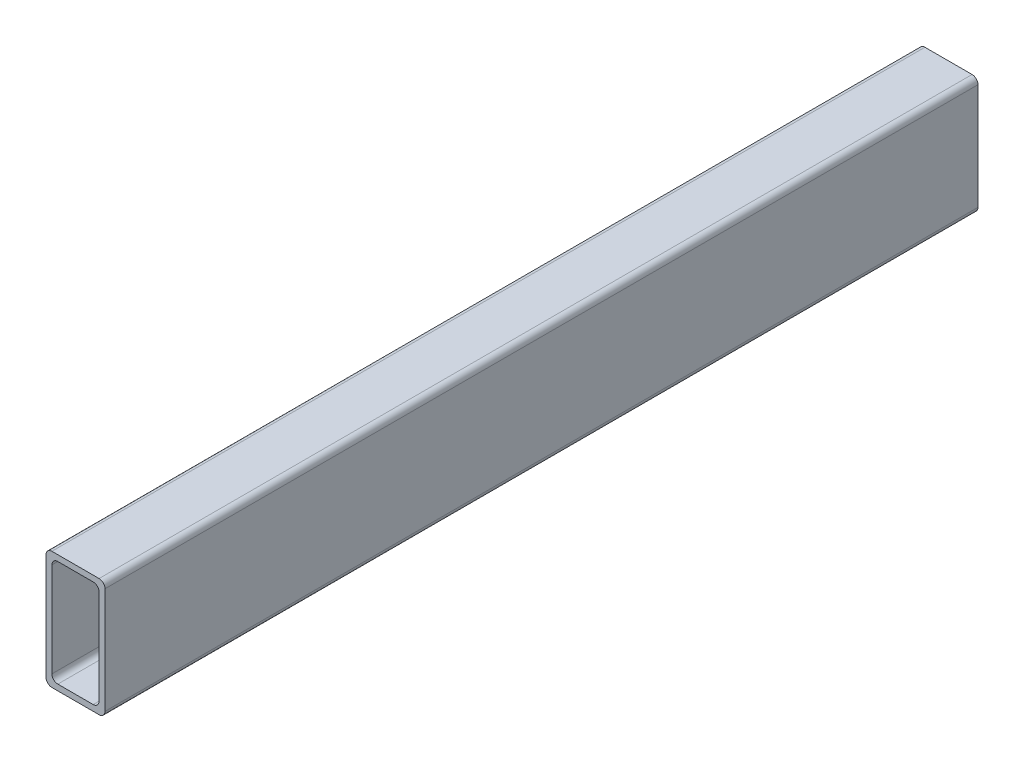
ISO-10303-21;
HEADER;
FILE_DESCRIPTION(('STEP AP214'),'2;1');
FILE_NAME('part.step','',(''),(''),'','','');
FILE_SCHEMA(('AUTOMOTIVE_DESIGN { 1 0 10303 214 1 1 1 1 }'));
ENDSEC;
DATA;
#1=APPLICATION_CONTEXT('core data for automotive mechanical design processes');
#2=APPLICATION_PROTOCOL_DEFINITION('international standard','automotive_design',2000,#1);
#3=PRODUCT_CONTEXT('',#1,'mechanical');
#4=PRODUCT('Part','Part','',(#3));
#5=PRODUCT_RELATED_PRODUCT_CATEGORY('part','',(#4));
#6=PRODUCT_DEFINITION_FORMATION('','',#4);
#7=PRODUCT_DEFINITION_CONTEXT('part definition',#1,'design');
#8=PRODUCT_DEFINITION('design','',#6,#7);
#9=PRODUCT_DEFINITION_SHAPE('','',#8);
#10=(LENGTH_UNIT() NAMED_UNIT(*) SI_UNIT(.MILLI.,.METRE.));
#11=(NAMED_UNIT(*) PLANE_ANGLE_UNIT() SI_UNIT($,.RADIAN.));
#12=(NAMED_UNIT(*) SI_UNIT($,.STERADIAN.) SOLID_ANGLE_UNIT());
#13=UNCERTAINTY_MEASURE_WITH_UNIT(LENGTH_MEASURE(1.E-05),#10,'distance_accuracy_value','');
#14=(GEOMETRIC_REPRESENTATION_CONTEXT(3) GLOBAL_UNCERTAINTY_ASSIGNED_CONTEXT((#13)) GLOBAL_UNIT_ASSIGNED_CONTEXT((#10,
#11,#12)) REPRESENTATION_CONTEXT('',''));
#15=CARTESIAN_POINT('',(0.,0.,0.));
#16=DIRECTION('',(0.,0.,1.));
#17=DIRECTION('',(1.,0.,0.));
#18=AXIS2_PLACEMENT_3D('',#15,#16,#17);
#19=CARTESIAN_POINT('',(-10.0000000000002,47.5000000000001,-370.));
#20=DIRECTION('',(0.,0.,1.));
#21=DIRECTION('',(1.,0.,0.));
#22=AXIS2_PLACEMENT_3D('',#19,#20,#21);
#23=CYLINDRICAL_SURFACE('',#22,2.49999999999995);
#24=CARTESIAN_POINT('',(-10.0000000000002,47.5000000000001,0.));
#25=DIRECTION('',(0.,0.,1.));
#26=DIRECTION('',(1.,0.,0.));
#27=AXIS2_PLACEMENT_3D('',#24,#25,#26);
#28=CIRCLE('',#27,2.49999999999995);
#29=CARTESIAN_POINT('',(-10.0000000000002,50.,0.));
#30=VERTEX_POINT('',#29);
#31=CARTESIAN_POINT('',(-12.5000000000002,47.5000000000001,0.));
#32=VERTEX_POINT('',#31);
#33=EDGE_CURVE('E203',#30,#32,#28,.T.);
#34=ORIENTED_EDGE('',*,*,#33,.F.);
#35=DIRECTION('',(0.,0.,1.));
#36=VECTOR('',#35,1.);
#37=CARTESIAN_POINT('',(-10.0000000000002,50.,-370.));
#38=LINE('',#37,#36);
#39=CARTESIAN_POINT('',(-10.0000000000002,50.,-370.));
#40=VERTEX_POINT('',#39);
#41=EDGE_CURVE('E11',#40,#30,#38,.T.);
#42=ORIENTED_EDGE('',*,*,#41,.F.);
#43=CARTESIAN_POINT('',(-10.0000000000002,47.5000000000001,-370.));
#44=DIRECTION('',(0.,0.,1.));
#45=DIRECTION('',(1.,0.,0.));
#46=AXIS2_PLACEMENT_3D('',#43,#44,#45);
#47=CIRCLE('',#46,2.49999999999995);
#48=CARTESIAN_POINT('',(-12.5000000000002,47.5000000000001,-370.));
#49=VERTEX_POINT('',#48);
#50=EDGE_CURVE('E215',#40,#49,#47,.T.);
#51=ORIENTED_EDGE('',*,*,#50,.T.);
#52=DIRECTION('',(0.,0.,1.));
#53=VECTOR('',#52,1.);
#54=CARTESIAN_POINT('',(-12.5000000000002,47.5000000000001,-370.));
#55=LINE('',#54,#53);
#56=EDGE_CURVE('E36',#49,#32,#55,.T.);
#57=ORIENTED_EDGE('',*,*,#56,.T.);
#58=EDGE_LOOP('',(#34,#42,#51,#57));
#59=FACE_BOUND('',#58,.T.);
#60=ADVANCED_FACE('F33',(#59),#23,.T.);
#61=CARTESIAN_POINT('',(-10.0000000000002,50.,-370.));
#62=DIRECTION('',(0.,1.,0.));
#63=DIRECTION('',(0.,0.,1.));
#64=AXIS2_PLACEMENT_3D('',#61,#62,#63);
#65=PLANE('',#64);
#66=DIRECTION('',(-1.,0.,0.));
#67=VECTOR('',#66,1.);
#68=CARTESIAN_POINT('',(-10.0000000000002,50.,0.));
#69=LINE('',#68,#67);
#70=CARTESIAN_POINT('',(9.99999999999979,50.,0.));
#71=VERTEX_POINT('',#70);
#72=EDGE_CURVE('E219',#71,#30,#69,.T.);
#73=ORIENTED_EDGE('',*,*,#72,.F.);
#74=DIRECTION('',(0.,0.,1.));
#75=VECTOR('',#74,1.);
#76=CARTESIAN_POINT('',(9.99999999999979,50.,-370.));
#77=LINE('',#76,#75);
#78=CARTESIAN_POINT('',(9.99999999999979,50.,-370.));
#79=VERTEX_POINT('',#78);
#80=EDGE_CURVE('E41',#79,#71,#77,.T.);
#81=ORIENTED_EDGE('',*,*,#80,.F.);
#82=DIRECTION('',(-1.,0.,0.));
#83=VECTOR('',#82,1.);
#84=CARTESIAN_POINT('',(-10.0000000000002,50.,-370.));
#85=LINE('',#84,#83);
#86=EDGE_CURVE('E237',#79,#40,#85,.T.);
#87=ORIENTED_EDGE('',*,*,#86,.T.);
#88=ORIENTED_EDGE('',*,*,#41,.T.);
#89=EDGE_LOOP('',(#73,#81,#87,#88));
#90=FACE_BOUND('',#89,.T.);
#91=ADVANCED_FACE('F284',(#90),#65,.T.);
#92=CARTESIAN_POINT('',(9.99999999999934,47.5000000000001,-370.));
#93=DIRECTION('',(0.,0.,1.));
#94=DIRECTION('',(1.,0.,0.));
#95=AXIS2_PLACEMENT_3D('',#92,#93,#94);
#96=CYLINDRICAL_SURFACE('',#95,2.50000000000017);
#97=CARTESIAN_POINT('',(9.99999999999934,47.5000000000001,0.));
#98=DIRECTION('',(0.,0.,1.));
#99=DIRECTION('',(1.,0.,0.));
#100=AXIS2_PLACEMENT_3D('',#97,#98,#99);
#101=CIRCLE('',#100,2.50000000000017);
#102=CARTESIAN_POINT('',(12.4999999999995,47.5000000000001,0.));
#103=VERTEX_POINT('',#102);
#104=EDGE_CURVE('E257',#103,#71,#101,.T.);
#105=ORIENTED_EDGE('',*,*,#104,.F.);
#106=DIRECTION('',(0.,0.,1.));
#107=VECTOR('',#106,1.);
#108=CARTESIAN_POINT('',(12.4999999999995,47.5000000000001,-370.));
#109=LINE('',#108,#107);
#110=CARTESIAN_POINT('',(12.4999999999995,47.5000000000001,-370.));
#111=VERTEX_POINT('',#110);
#112=EDGE_CURVE('E263',#111,#103,#109,.T.);
#113=ORIENTED_EDGE('',*,*,#112,.F.);
#114=CARTESIAN_POINT('',(9.99999999999934,47.5000000000001,-370.));
#115=DIRECTION('',(0.,0.,1.));
#116=DIRECTION('',(1.,0.,0.));
#117=AXIS2_PLACEMENT_3D('',#114,#115,#116);
#118=CIRCLE('',#117,2.50000000000017);
#119=EDGE_CURVE('E234',#111,#79,#118,.T.);
#120=ORIENTED_EDGE('',*,*,#119,.T.);
#121=ORIENTED_EDGE('',*,*,#80,.T.);
#122=EDGE_LOOP('',(#105,#113,#120,#121));
#123=FACE_BOUND('',#122,.T.);
#124=ADVANCED_FACE('F303',(#123),#96,.T.);
#125=CARTESIAN_POINT('',(12.4999999999997,47.5000000000001,-370.));
#126=DIRECTION('',(1.,0.,0.));
#127=DIRECTION('',(0.,0.,-1.));
#128=AXIS2_PLACEMENT_3D('',#125,#126,#127);
#129=PLANE('',#128);
#130=DIRECTION('',(0.,1.,0.));
#131=VECTOR('',#130,1.);
#132=CARTESIAN_POINT('',(12.4999999999997,47.5000000000001,0.));
#133=LINE('',#132,#131);
#134=CARTESIAN_POINT('',(12.4999999999997,2.49999999999995,0.));
#135=VERTEX_POINT('',#134);
#136=EDGE_CURVE('E254',#135,#103,#133,.T.);
#137=ORIENTED_EDGE('',*,*,#136,.F.);
#138=DIRECTION('',(0.,0.,1.));
#139=VECTOR('',#138,1.);
#140=CARTESIAN_POINT('',(12.4999999999997,2.49999999999995,-370.));
#141=LINE('',#140,#139);
#142=CARTESIAN_POINT('',(12.4999999999997,2.49999999999995,-370.));
#143=VERTEX_POINT('',#142);
#144=EDGE_CURVE('E265',#143,#135,#141,.T.);
#145=ORIENTED_EDGE('',*,*,#144,.F.);
#146=DIRECTION('',(0.,1.,0.));
#147=VECTOR('',#146,1.);
#148=CARTESIAN_POINT('',(12.4999999999997,47.5000000000001,-370.));
#149=LINE('',#148,#147);
#150=EDGE_CURVE('E231',#143,#111,#149,.T.);
#151=ORIENTED_EDGE('',*,*,#150,.T.);
#152=ORIENTED_EDGE('',*,*,#112,.T.);
#153=EDGE_LOOP('',(#137,#145,#151,#152));
#154=FACE_BOUND('',#153,.T.);
#155=ADVANCED_FACE('F301',(#154),#129,.T.);
#156=CARTESIAN_POINT('',(9.99999999999934,2.49999999999995,-370.));
#157=DIRECTION('',(0.,0.,1.));
#158=DIRECTION('',(1.,0.,0.));
#159=AXIS2_PLACEMENT_3D('',#156,#157,#158);
#160=CYLINDRICAL_SURFACE('',#159,2.50000000000017);
#161=CARTESIAN_POINT('',(9.99999999999934,2.49999999999995,0.));
#162=DIRECTION('',(0.,0.,1.));
#163=DIRECTION('',(1.,0.,0.));
#164=AXIS2_PLACEMENT_3D('',#161,#162,#163);
#165=CIRCLE('',#164,2.50000000000017);
#166=CARTESIAN_POINT('',(9.99999999999934,-2.22044604925031E-13,0.));
#167=VERTEX_POINT('',#166);
#168=EDGE_CURVE('E251',#167,#135,#165,.T.);
#169=ORIENTED_EDGE('',*,*,#168,.F.);
#170=DIRECTION('',(0.,0.,1.));
#171=VECTOR('',#170,1.);
#172=CARTESIAN_POINT('',(9.99999999999934,-2.22044604925031E-13,-370.));
#173=LINE('',#172,#171);
#174=CARTESIAN_POINT('',(9.99999999999934,-2.22044604925031E-13,-370.));
#175=VERTEX_POINT('',#174);
#176=EDGE_CURVE('E267',#175,#167,#173,.T.);
#177=ORIENTED_EDGE('',*,*,#176,.F.);
#178=CARTESIAN_POINT('',(9.99999999999934,2.49999999999995,-370.));
#179=DIRECTION('',(0.,0.,1.));
#180=DIRECTION('',(1.,0.,0.));
#181=AXIS2_PLACEMENT_3D('',#178,#179,#180);
#182=CIRCLE('',#181,2.50000000000017);
#183=EDGE_CURVE('E228',#175,#143,#182,.T.);
#184=ORIENTED_EDGE('',*,*,#183,.T.);
#185=ORIENTED_EDGE('',*,*,#144,.T.);
#186=EDGE_LOOP('',(#169,#177,#184,#185));
#187=FACE_BOUND('',#186,.T.);
#188=ADVANCED_FACE('F297',(#187),#160,.T.);
#189=CARTESIAN_POINT('',(9.99999999999934,0.,-370.));
#190=DIRECTION('',(0.,-1.,0.));
#191=DIRECTION('',(0.,0.,-1.));
#192=AXIS2_PLACEMENT_3D('',#189,#190,#191);
#193=PLANE('',#192);
#194=DIRECTION('',(1.,0.,0.));
#195=VECTOR('',#194,1.);
#196=CARTESIAN_POINT('',(9.99999999999934,0.,0.));
#197=LINE('',#196,#195);
#198=CARTESIAN_POINT('',(-10.0000000000002,0.,0.));
#199=VERTEX_POINT('',#198);
#200=EDGE_CURVE('E248',#199,#167,#197,.T.);
#201=ORIENTED_EDGE('',*,*,#200,.F.);
#202=DIRECTION('',(0.,0.,1.));
#203=VECTOR('',#202,1.);
#204=CARTESIAN_POINT('',(-10.0000000000002,0.,-370.));
#205=LINE('',#204,#203);
#206=CARTESIAN_POINT('',(-10.0000000000002,0.,-370.));
#207=VERTEX_POINT('',#206);
#208=EDGE_CURVE('E269',#207,#199,#205,.T.);
#209=ORIENTED_EDGE('',*,*,#208,.F.);
#210=DIRECTION('',(1.,0.,0.));
#211=VECTOR('',#210,1.);
#212=CARTESIAN_POINT('',(9.99999999999934,0.,-370.));
#213=LINE('',#212,#211);
#214=EDGE_CURVE('E225',#207,#175,#213,.T.);
#215=ORIENTED_EDGE('',*,*,#214,.T.);
#216=ORIENTED_EDGE('',*,*,#176,.T.);
#217=EDGE_LOOP('',(#201,#209,#215,#216));
#218=FACE_BOUND('',#217,.T.);
#219=ADVANCED_FACE('F295',(#218),#193,.T.);
#220=CARTESIAN_POINT('',(-10.0000000000002,2.49999999999995,-370.));
#221=DIRECTION('',(0.,0.,1.));
#222=DIRECTION('',(1.,0.,0.));
#223=AXIS2_PLACEMENT_3D('',#220,#221,#222);
#224=CYLINDRICAL_SURFACE('',#223,2.49999999999995);
#225=CARTESIAN_POINT('',(-10.0000000000002,2.49999999999995,0.));
#226=DIRECTION('',(0.,0.,1.));
#227=DIRECTION('',(1.,0.,0.));
#228=AXIS2_PLACEMENT_3D('',#225,#226,#227);
#229=CIRCLE('',#228,2.49999999999995);
#230=CARTESIAN_POINT('',(-12.5000000000002,2.49999999999995,0.));
#231=VERTEX_POINT('',#230);
#232=EDGE_CURVE('E245',#231,#199,#229,.T.);
#233=ORIENTED_EDGE('',*,*,#232,.F.);
#234=DIRECTION('',(0.,0.,1.));
#235=VECTOR('',#234,1.);
#236=CARTESIAN_POINT('',(-12.5000000000002,2.49999999999995,-370.));
#237=LINE('',#236,#235);
#238=CARTESIAN_POINT('',(-12.5000000000002,2.49999999999995,-370.));
#239=VERTEX_POINT('',#238);
#240=EDGE_CURVE('E270',#239,#231,#237,.T.);
#241=ORIENTED_EDGE('',*,*,#240,.F.);
#242=CARTESIAN_POINT('',(-10.0000000000002,2.49999999999995,-370.));
#243=DIRECTION('',(0.,0.,1.));
#244=DIRECTION('',(1.,0.,0.));
#245=AXIS2_PLACEMENT_3D('',#242,#243,#244);
#246=CIRCLE('',#245,2.49999999999995);
#247=EDGE_CURVE('E222',#239,#207,#246,.T.);
#248=ORIENTED_EDGE('',*,*,#247,.T.);
#249=ORIENTED_EDGE('',*,*,#208,.T.);
#250=EDGE_LOOP('',(#233,#241,#248,#249));
#251=FACE_BOUND('',#250,.T.);
#252=ADVANCED_FACE('F291',(#251),#224,.T.);
#253=CARTESIAN_POINT('',(-12.5000000000002,2.49999999999995,-370.));
#254=DIRECTION('',(-1.,0.,0.));
#255=DIRECTION('',(0.,0.,1.));
#256=AXIS2_PLACEMENT_3D('',#253,#254,#255);
#257=PLANE('',#256);
#258=DIRECTION('',(0.,-1.,0.));
#259=VECTOR('',#258,1.);
#260=CARTESIAN_POINT('',(-12.5000000000002,2.49999999999995,0.));
#261=LINE('',#260,#259);
#262=EDGE_CURVE('E242',#32,#231,#261,.T.);
#263=ORIENTED_EDGE('',*,*,#262,.F.);
#264=ORIENTED_EDGE('',*,*,#56,.F.);
#265=DIRECTION('',(0.,-1.,0.));
#266=VECTOR('',#265,1.);
#267=CARTESIAN_POINT('',(-12.5000000000002,2.49999999999995,-370.));
#268=LINE('',#267,#266);
#269=EDGE_CURVE('E218',#49,#239,#268,.T.);
#270=ORIENTED_EDGE('',*,*,#269,.T.);
#271=ORIENTED_EDGE('',*,*,#240,.T.);
#272=EDGE_LOOP('',(#263,#264,#270,#271));
#273=FACE_BOUND('',#272,.T.);
#274=ADVANCED_FACE('F278',(#273),#257,.T.);
#275=CARTESIAN_POINT('',(-10.0000000000002,47.5000000000001,-370.));
#276=DIRECTION('',(0.,0.,1.));
#277=DIRECTION('',(1.,0.,0.));
#278=AXIS2_PLACEMENT_3D('',#275,#276,#277);
#279=PLANE('',#278);
#280=DIRECTION('',(-1.,0.,0.));
#281=VECTOR('',#280,1.);
#282=CARTESIAN_POINT('',(-7.50000000000028,47.5000000000001,-370.));
#283=LINE('',#282,#281);
#284=CARTESIAN_POINT('',(7.49999999999984,47.5000000000001,-370.));
#285=VERTEX_POINT('',#284);
#286=CARTESIAN_POINT('',(-7.50000000000028,47.5000000000001,-370.));
#287=VERTEX_POINT('',#286);
#288=EDGE_CURVE('E154',#285,#287,#283,.T.);
#289=ORIENTED_EDGE('',*,*,#288,.T.);
#290=CARTESIAN_POINT('',(-7.49999999999984,45.0000000000001,-370.));
#291=DIRECTION('',(0.,0.,1.));
#292=DIRECTION('',(1.,0.,0.));
#293=AXIS2_PLACEMENT_3D('',#290,#291,#292);
#294=CIRCLE('',#293,2.50000000000017);
#295=CARTESIAN_POINT('',(-10.0000000000002,45.0000000000001,-370.));
#296=VERTEX_POINT('',#295);
#297=EDGE_CURVE('E148',#287,#296,#294,.T.);
#298=ORIENTED_EDGE('',*,*,#297,.T.);
#299=DIRECTION('',(0.,-1.,0.));
#300=VECTOR('',#299,1.);
#301=CARTESIAN_POINT('',(-10.0000000000002,4.99999999999989,-370.));
#302=LINE('',#301,#300);
#303=CARTESIAN_POINT('',(-10.0000000000002,4.99999999999989,-370.));
#304=VERTEX_POINT('',#303);
#305=EDGE_CURVE('E157',#296,#304,#302,.T.);
#306=ORIENTED_EDGE('',*,*,#305,.T.);
#307=CARTESIAN_POINT('',(-7.49999999999984,4.99999999999989,-370.));
#308=DIRECTION('',(0.,0.,1.));
#309=DIRECTION('',(1.,0.,0.));
#310=AXIS2_PLACEMENT_3D('',#307,#308,#309);
#311=CIRCLE('',#310,2.50000000000017);
#312=CARTESIAN_POINT('',(-7.50000000000028,2.49999999999995,-370.));
#313=VERTEX_POINT('',#312);
#314=EDGE_CURVE('E49',#304,#313,#311,.T.);
#315=ORIENTED_EDGE('',*,*,#314,.T.);
#316=DIRECTION('',(1.,0.,0.));
#317=VECTOR('',#316,1.);
#318=CARTESIAN_POINT('',(7.49999999999984,2.49999999999995,-370.));
#319=LINE('',#318,#317);
#320=CARTESIAN_POINT('',(7.49999999999984,2.49999999999995,-370.));
#321=VERTEX_POINT('',#320);
#322=EDGE_CURVE('E172',#313,#321,#319,.T.);
#323=ORIENTED_EDGE('',*,*,#322,.T.);
#324=CARTESIAN_POINT('',(7.49999999999984,4.99999999999989,-370.));
#325=DIRECTION('',(0.,0.,1.));
#326=DIRECTION('',(1.,0.,0.));
#327=AXIS2_PLACEMENT_3D('',#324,#325,#326);
#328=CIRCLE('',#327,2.49999999999995);
#329=CARTESIAN_POINT('',(9.99999999999979,5.00000000000012,-370.));
#330=VERTEX_POINT('',#329);
#331=EDGE_CURVE('E175',#321,#330,#328,.T.);
#332=ORIENTED_EDGE('',*,*,#331,.T.);
#333=DIRECTION('',(0.,1.,0.));
#334=VECTOR('',#333,1.);
#335=CARTESIAN_POINT('',(9.99999999999979,45.0000000000001,-370.));
#336=LINE('',#335,#334);
#337=CARTESIAN_POINT('',(9.99999999999979,45.0000000000001,-370.));
#338=VERTEX_POINT('',#337);
#339=EDGE_CURVE('E178',#330,#338,#336,.T.);
#340=ORIENTED_EDGE('',*,*,#339,.T.);
#341=CARTESIAN_POINT('',(7.49999999999984,45.0000000000001,-370.));
#342=DIRECTION('',(0.,0.,1.));
#343=DIRECTION('',(1.,0.,0.));
#344=AXIS2_PLACEMENT_3D('',#341,#342,#343);
#345=CIRCLE('',#344,2.49999999999995);
#346=EDGE_CURVE('E181',#338,#285,#345,.T.);
#347=ORIENTED_EDGE('',*,*,#346,.T.);
#348=EDGE_LOOP('',(#289,#298,#306,#315,#323,#332,#340,#347));
#349=FACE_BOUND('',#348,.T.);
#350=ORIENTED_EDGE('',*,*,#50,.F.);
#351=ORIENTED_EDGE('',*,*,#86,.F.);
#352=ORIENTED_EDGE('',*,*,#119,.F.);
#353=ORIENTED_EDGE('',*,*,#150,.F.);
#354=ORIENTED_EDGE('',*,*,#183,.F.);
#355=ORIENTED_EDGE('',*,*,#214,.F.);
#356=ORIENTED_EDGE('',*,*,#247,.F.);
#357=ORIENTED_EDGE('',*,*,#269,.F.);
#358=EDGE_LOOP('',(#350,#351,#352,#353,#354,#355,#356,#357));
#359=FACE_BOUND('',#358,.T.);
#360=ADVANCED_FACE('F161',(#349,#359),#279,.F.);
#361=CARTESIAN_POINT('',(-10.0000000000002,47.5000000000001,0.));
#362=DIRECTION('',(0.,0.,1.));
#363=DIRECTION('',(1.,0.,0.));
#364=AXIS2_PLACEMENT_3D('',#361,#362,#363);
#365=PLANE('',#364);
#366=CARTESIAN_POINT('',(-7.49999999999984,45.0000000000001,0.));
#367=DIRECTION('',(0.,0.,1.));
#368=DIRECTION('',(1.,0.,0.));
#369=AXIS2_PLACEMENT_3D('',#366,#367,#368);
#370=CIRCLE('',#369,2.50000000000017);
#371=CARTESIAN_POINT('',(-7.50000000000028,47.5000000000001,0.));
#372=VERTEX_POINT('',#371);
#373=CARTESIAN_POINT('',(-10.0000000000002,45.0000000000001,0.));
#374=VERTEX_POINT('',#373);
#375=EDGE_CURVE('E57',#372,#374,#370,.T.);
#376=ORIENTED_EDGE('',*,*,#375,.F.);
#377=DIRECTION('',(-1.,0.,0.));
#378=VECTOR('',#377,1.);
#379=CARTESIAN_POINT('',(-7.50000000000028,47.5000000000001,0.));
#380=LINE('',#379,#378);
#381=CARTESIAN_POINT('',(7.49999999999984,47.5000000000001,0.));
#382=VERTEX_POINT('',#381);
#383=EDGE_CURVE('E165',#382,#372,#380,.T.);
#384=ORIENTED_EDGE('',*,*,#383,.F.);
#385=CARTESIAN_POINT('',(7.49999999999984,45.0000000000001,0.));
#386=DIRECTION('',(0.,0.,1.));
#387=DIRECTION('',(1.,0.,0.));
#388=AXIS2_PLACEMENT_3D('',#385,#386,#387);
#389=CIRCLE('',#388,2.49999999999995);
#390=CARTESIAN_POINT('',(9.99999999999979,45.0000000000001,0.));
#391=VERTEX_POINT('',#390);
#392=EDGE_CURVE('E168',#391,#382,#389,.T.);
#393=ORIENTED_EDGE('',*,*,#392,.F.);
#394=DIRECTION('',(0.,1.,0.));
#395=VECTOR('',#394,1.);
#396=CARTESIAN_POINT('',(9.99999999999979,45.0000000000001,0.));
#397=LINE('',#396,#395);
#398=CARTESIAN_POINT('',(9.99999999999979,5.00000000000012,0.));
#399=VERTEX_POINT('',#398);
#400=EDGE_CURVE('E196',#399,#391,#397,.T.);
#401=ORIENTED_EDGE('',*,*,#400,.F.);
#402=CARTESIAN_POINT('',(7.49999999999984,4.99999999999989,0.));
#403=DIRECTION('',(0.,0.,1.));
#404=DIRECTION('',(1.,0.,0.));
#405=AXIS2_PLACEMENT_3D('',#402,#403,#404);
#406=CIRCLE('',#405,2.49999999999995);
#407=CARTESIAN_POINT('',(7.49999999999984,2.49999999999995,0.));
#408=VERTEX_POINT('',#407);
#409=EDGE_CURVE('E193',#408,#399,#406,.T.);
#410=ORIENTED_EDGE('',*,*,#409,.F.);
#411=DIRECTION('',(1.,0.,0.));
#412=VECTOR('',#411,1.);
#413=CARTESIAN_POINT('',(7.49999999999984,2.49999999999995,0.));
#414=LINE('',#413,#412);
#415=CARTESIAN_POINT('',(-7.50000000000028,2.49999999999995,0.));
#416=VERTEX_POINT('',#415);
#417=EDGE_CURVE('E190',#416,#408,#414,.T.);
#418=ORIENTED_EDGE('',*,*,#417,.F.);
#419=CARTESIAN_POINT('',(-7.49999999999984,4.99999999999989,0.));
#420=DIRECTION('',(0.,0.,1.));
#421=DIRECTION('',(1.,0.,0.));
#422=AXIS2_PLACEMENT_3D('',#419,#420,#421);
#423=CIRCLE('',#422,2.50000000000017);
#424=CARTESIAN_POINT('',(-10.,4.99999999999989,0.));
#425=VERTEX_POINT('',#424);
#426=EDGE_CURVE('E187',#425,#416,#423,.T.);
#427=ORIENTED_EDGE('',*,*,#426,.F.);
#428=DIRECTION('',(0.,-1.,0.));
#429=VECTOR('',#428,1.);
#430=CARTESIAN_POINT('',(-10.0000000000002,4.99999999999989,0.));
#431=LINE('',#430,#429);
#432=EDGE_CURVE('E185',#374,#425,#431,.T.);
#433=ORIENTED_EDGE('',*,*,#432,.F.);
#434=EDGE_LOOP('',(#376,#384,#393,#401,#410,#418,#427,#433));
#435=FACE_BOUND('',#434,.T.);
#436=ORIENTED_EDGE('',*,*,#33,.T.);
#437=ORIENTED_EDGE('',*,*,#262,.T.);
#438=ORIENTED_EDGE('',*,*,#232,.T.);
#439=ORIENTED_EDGE('',*,*,#200,.T.);
#440=ORIENTED_EDGE('',*,*,#168,.T.);
#441=ORIENTED_EDGE('',*,*,#136,.T.);
#442=ORIENTED_EDGE('',*,*,#104,.T.);
#443=ORIENTED_EDGE('',*,*,#72,.T.);
#444=EDGE_LOOP('',(#436,#437,#438,#439,#440,#441,#442,#443));
#445=FACE_BOUND('',#444,.T.);
#446=ADVANCED_FACE('F280',(#435,#445),#365,.T.);
#447=CARTESIAN_POINT('',(-7.49999999999984,45.0000000000001,-370.));
#448=DIRECTION('',(0.,0.,1.));
#449=DIRECTION('',(1.,0.,0.));
#450=AXIS2_PLACEMENT_3D('',#447,#448,#449);
#451=CYLINDRICAL_SURFACE('',#450,2.50000000000017);
#452=ORIENTED_EDGE('',*,*,#375,.T.);
#453=DIRECTION('',(0.,0.,1.));
#454=VECTOR('',#453,1.);
#455=CARTESIAN_POINT('',(-10.0000000000002,45.0000000000001,-370.));
#456=LINE('',#455,#454);
#457=EDGE_CURVE('E144',#296,#374,#456,.T.);
#458=ORIENTED_EDGE('',*,*,#457,.F.);
#459=ORIENTED_EDGE('',*,*,#297,.F.);
#460=DIRECTION('',(0.,0.,1.));
#461=VECTOR('',#460,1.);
#462=CARTESIAN_POINT('',(-7.50000000000028,47.5000000000001,-370.));
#463=LINE('',#462,#461);
#464=EDGE_CURVE('E201',#287,#372,#463,.T.);
#465=ORIENTED_EDGE('',*,*,#464,.T.);
#466=EDGE_LOOP('',(#452,#458,#459,#465));
#467=FACE_BOUND('',#466,.T.);
#468=ADVANCED_FACE('F146',(#467),#451,.F.);
#469=CARTESIAN_POINT('',(-7.50000000000028,47.5000000000001,-370.));
#470=DIRECTION('',(0.,1.,0.));
#471=DIRECTION('',(0.,0.,1.));
#472=AXIS2_PLACEMENT_3D('',#469,#470,#471);
#473=PLANE('',#472);
#474=ORIENTED_EDGE('',*,*,#383,.T.);
#475=ORIENTED_EDGE('',*,*,#464,.F.);
#476=ORIENTED_EDGE('',*,*,#288,.F.);
#477=DIRECTION('',(0.,0.,1.));
#478=VECTOR('',#477,1.);
#479=CARTESIAN_POINT('',(7.49999999999984,47.5000000000001,-370.));
#480=LINE('',#479,#478);
#481=EDGE_CURVE('E204',#285,#382,#480,.T.);
#482=ORIENTED_EDGE('',*,*,#481,.T.);
#483=EDGE_LOOP('',(#474,#475,#476,#482));
#484=FACE_BOUND('',#483,.T.);
#485=ADVANCED_FACE('F386',(#484),#473,.F.);
#486=CARTESIAN_POINT('',(7.49999999999984,45.0000000000001,-370.));
#487=DIRECTION('',(0.,0.,1.));
#488=DIRECTION('',(1.,0.,0.));
#489=AXIS2_PLACEMENT_3D('',#486,#487,#488);
#490=CYLINDRICAL_SURFACE('',#489,2.49999999999995);
#491=ORIENTED_EDGE('',*,*,#392,.T.);
#492=ORIENTED_EDGE('',*,*,#481,.F.);
#493=ORIENTED_EDGE('',*,*,#346,.F.);
#494=DIRECTION('',(0.,0.,1.));
#495=VECTOR('',#494,1.);
#496=CARTESIAN_POINT('',(9.99999999999979,45.0000000000001,-370.));
#497=LINE('',#496,#495);
#498=EDGE_CURVE('E206',#338,#391,#497,.T.);
#499=ORIENTED_EDGE('',*,*,#498,.T.);
#500=EDGE_LOOP('',(#491,#492,#493,#499));
#501=FACE_BOUND('',#500,.T.);
#502=ADVANCED_FACE('F395',(#501),#490,.F.);
#503=CARTESIAN_POINT('',(9.99999999999979,45.0000000000001,-370.));
#504=DIRECTION('',(1.,0.,0.));
#505=DIRECTION('',(0.,0.,-1.));
#506=AXIS2_PLACEMENT_3D('',#503,#504,#505);
#507=PLANE('',#506);
#508=ORIENTED_EDGE('',*,*,#400,.T.);
#509=ORIENTED_EDGE('',*,*,#498,.F.);
#510=ORIENTED_EDGE('',*,*,#339,.F.);
#511=DIRECTION('',(0.,0.,1.));
#512=VECTOR('',#511,1.);
#513=CARTESIAN_POINT('',(9.99999999999979,5.00000000000012,-370.));
#514=LINE('',#513,#512);
#515=EDGE_CURVE('E208',#330,#399,#514,.T.);
#516=ORIENTED_EDGE('',*,*,#515,.T.);
#517=EDGE_LOOP('',(#508,#509,#510,#516));
#518=FACE_BOUND('',#517,.T.);
#519=ADVANCED_FACE('F405',(#518),#507,.F.);
#520=CARTESIAN_POINT('',(7.49999999999984,4.99999999999989,-370.));
#521=DIRECTION('',(0.,0.,1.));
#522=DIRECTION('',(1.,0.,0.));
#523=AXIS2_PLACEMENT_3D('',#520,#521,#522);
#524=CYLINDRICAL_SURFACE('',#523,2.49999999999995);
#525=ORIENTED_EDGE('',*,*,#409,.T.);
#526=ORIENTED_EDGE('',*,*,#515,.F.);
#527=ORIENTED_EDGE('',*,*,#331,.F.);
#528=DIRECTION('',(0.,0.,1.));
#529=VECTOR('',#528,1.);
#530=CARTESIAN_POINT('',(7.49999999999984,2.49999999999995,-370.));
#531=LINE('',#530,#529);
#532=EDGE_CURVE('E210',#321,#408,#531,.T.);
#533=ORIENTED_EDGE('',*,*,#532,.T.);
#534=EDGE_LOOP('',(#525,#526,#527,#533));
#535=FACE_BOUND('',#534,.T.);
#536=ADVANCED_FACE('F415',(#535),#524,.F.);
#537=CARTESIAN_POINT('',(7.49999999999984,2.49999999999995,-370.));
#538=DIRECTION('',(0.,-1.,0.));
#539=DIRECTION('',(0.,0.,-1.));
#540=AXIS2_PLACEMENT_3D('',#537,#538,#539);
#541=PLANE('',#540);
#542=ORIENTED_EDGE('',*,*,#417,.T.);
#543=ORIENTED_EDGE('',*,*,#532,.F.);
#544=ORIENTED_EDGE('',*,*,#322,.F.);
#545=DIRECTION('',(0.,0.,1.));
#546=VECTOR('',#545,1.);
#547=CARTESIAN_POINT('',(-7.50000000000028,2.49999999999995,-370.));
#548=LINE('',#547,#546);
#549=EDGE_CURVE('E212',#313,#416,#548,.T.);
#550=ORIENTED_EDGE('',*,*,#549,.T.);
#551=EDGE_LOOP('',(#542,#543,#544,#550));
#552=FACE_BOUND('',#551,.T.);
#553=ADVANCED_FACE('F425',(#552),#541,.F.);
#554=CARTESIAN_POINT('',(-7.49999999999984,4.99999999999989,-370.));
#555=DIRECTION('',(0.,0.,1.));
#556=DIRECTION('',(1.,0.,0.));
#557=AXIS2_PLACEMENT_3D('',#554,#555,#556);
#558=CYLINDRICAL_SURFACE('',#557,2.50000000000017);
#559=ORIENTED_EDGE('',*,*,#426,.T.);
#560=ORIENTED_EDGE('',*,*,#549,.F.);
#561=ORIENTED_EDGE('',*,*,#314,.F.);
#562=DIRECTION('',(0.,0.,1.));
#563=VECTOR('',#562,1.);
#564=CARTESIAN_POINT('',(-10.,4.99999999999989,-370.));
#565=LINE('',#564,#563);
#566=EDGE_CURVE('E153',#304,#425,#565,.T.);
#567=ORIENTED_EDGE('',*,*,#566,.T.);
#568=EDGE_LOOP('',(#559,#560,#561,#567));
#569=FACE_BOUND('',#568,.T.);
#570=ADVANCED_FACE('F435',(#569),#558,.F.);
#571=CARTESIAN_POINT('',(-10.0000000000002,4.99999999999989,-370.));
#572=DIRECTION('',(-1.,0.,0.));
#573=DIRECTION('',(0.,0.,1.));
#574=AXIS2_PLACEMENT_3D('',#571,#572,#573);
#575=PLANE('',#574);
#576=ORIENTED_EDGE('',*,*,#432,.T.);
#577=ORIENTED_EDGE('',*,*,#566,.F.);
#578=ORIENTED_EDGE('',*,*,#305,.F.);
#579=ORIENTED_EDGE('',*,*,#457,.T.);
#580=EDGE_LOOP('',(#576,#577,#578,#579));
#581=FACE_BOUND('',#580,.T.);
#582=ADVANCED_FACE('F158',(#581),#575,.F.);
#583=CLOSED_SHELL('',(#60,#91,#124,#155,#188,#219,#252,#274,#360,#446,#468,#485,#502,#519,#536,
#553,#570,#582));
#584=MANIFOLD_SOLID_BREP('B2',#583);
#585=ADVANCED_BREP_SHAPE_REPRESENTATION('',(#18,#584),#14);
#586=SHAPE_DEFINITION_REPRESENTATION(#9,#585);
ENDSEC;
END-ISO-10303-21;
